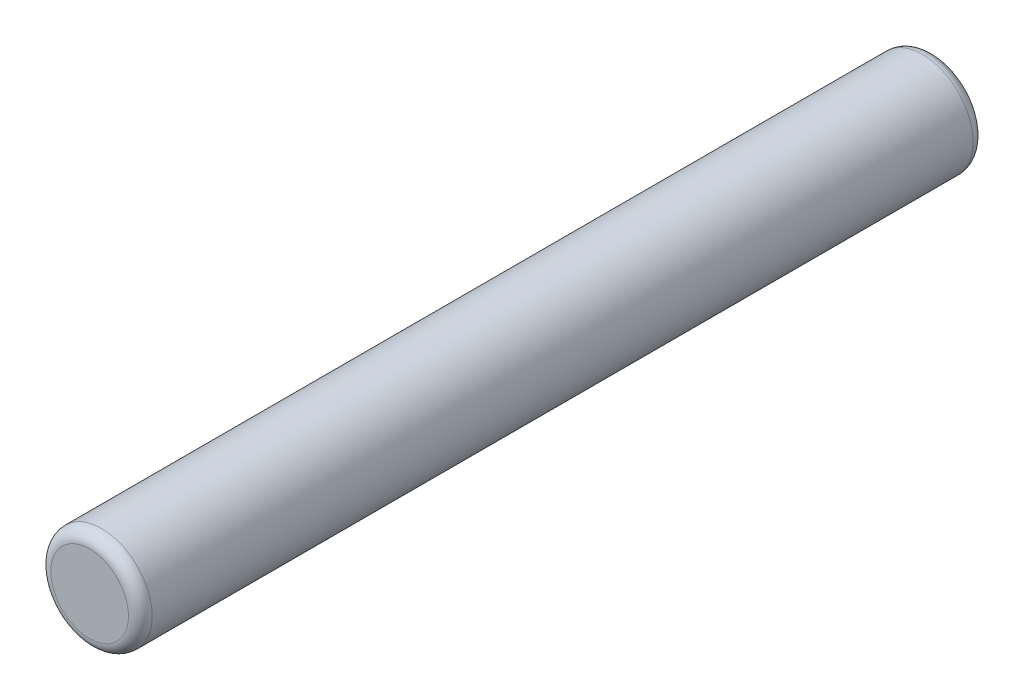
ISO-10303-21;
HEADER;
FILE_DESCRIPTION(('STEP AP214'),'2;1');
FILE_NAME('part.step','',(''),(''),'','','');
FILE_SCHEMA(('AUTOMOTIVE_DESIGN { 1 0 10303 214 1 1 1 1 }'));
ENDSEC;
DATA;
#1=APPLICATION_CONTEXT('core data for automotive mechanical design processes');
#2=APPLICATION_PROTOCOL_DEFINITION('international standard','automotive_design',2000,#1);
#3=PRODUCT_CONTEXT('',#1,'mechanical');
#4=PRODUCT('Part','Part','',(#3));
#5=PRODUCT_RELATED_PRODUCT_CATEGORY('part','',(#4));
#6=PRODUCT_DEFINITION_FORMATION('','',#4);
#7=PRODUCT_DEFINITION_CONTEXT('part definition',#1,'design');
#8=PRODUCT_DEFINITION('design','',#6,#7);
#9=PRODUCT_DEFINITION_SHAPE('','',#8);
#10=(LENGTH_UNIT() NAMED_UNIT(*) SI_UNIT(.MILLI.,.METRE.));
#11=(NAMED_UNIT(*) PLANE_ANGLE_UNIT() SI_UNIT($,.RADIAN.));
#12=(NAMED_UNIT(*) SI_UNIT($,.STERADIAN.) SOLID_ANGLE_UNIT());
#13=UNCERTAINTY_MEASURE_WITH_UNIT(LENGTH_MEASURE(1.E-05),#10,'distance_accuracy_value','');
#14=(GEOMETRIC_REPRESENTATION_CONTEXT(3) GLOBAL_UNCERTAINTY_ASSIGNED_CONTEXT((#13)) GLOBAL_UNIT_ASSIGNED_CONTEXT((#10,
#11,#12)) REPRESENTATION_CONTEXT('',''));
#15=CARTESIAN_POINT('',(0.,0.,0.));
#16=DIRECTION('',(0.,0.,1.));
#17=DIRECTION('',(1.,0.,0.));
#18=AXIS2_PLACEMENT_3D('',#15,#16,#17);
#19=CARTESIAN_POINT('',(0.,0.,12.5));
#20=DIRECTION('',(0.,0.,-1.));
#21=DIRECTION('',(-1.,0.,0.));
#22=AXIS2_PLACEMENT_3D('',#19,#20,#21);
#23=CYLINDRICAL_SURFACE('',#22,1.5);
#24=CARTESIAN_POINT('',(0.,0.,-12.15));
#25=DIRECTION('',(0.,0.,1.));
#26=DIRECTION('',(1.,0.,0.));
#27=AXIS2_PLACEMENT_3D('',#24,#25,#26);
#28=CIRCLE('',#27,1.5);
#29=CARTESIAN_POINT('',(1.5,0.,-12.15));
#30=VERTEX_POINT('',#29);
#31=EDGE_CURVE('E42',#30,#30,#28,.T.);
#32=ORIENTED_EDGE('',*,*,#31,.T.);
#33=EDGE_LOOP('',(#32));
#34=FACE_BOUND('',#33,.T.);
#35=CARTESIAN_POINT('',(0.,0.,12.15));
#36=DIRECTION('',(0.,0.,1.));
#37=DIRECTION('',(1.,0.,0.));
#38=AXIS2_PLACEMENT_3D('',#35,#36,#37);
#39=CIRCLE('',#38,1.5);
#40=CARTESIAN_POINT('',(1.5,0.,12.15));
#41=VERTEX_POINT('',#40);
#42=EDGE_CURVE('E46',#41,#41,#39,.F.);
#43=ORIENTED_EDGE('',*,*,#42,.T.);
#44=EDGE_LOOP('',(#43));
#45=FACE_BOUND('',#44,.T.);
#46=ADVANCED_FACE('F31',(#34,#45),#23,.T.);
#47=CARTESIAN_POINT('',(0.,0.,12.5));
#48=DIRECTION('',(0.,0.,1.));
#49=DIRECTION('',(1.,0.,0.));
#50=AXIS2_PLACEMENT_3D('',#47,#48,#49);
#51=PLANE('',#50);
#52=CARTESIAN_POINT('',(0.,0.,12.5));
#53=DIRECTION('',(0.,0.,1.));
#54=DIRECTION('',(1.,0.,0.));
#55=AXIS2_PLACEMENT_3D('',#52,#53,#54);
#56=CIRCLE('',#55,1.15);
#57=CARTESIAN_POINT('',(1.15,0.,12.5));
#58=VERTEX_POINT('',#57);
#59=EDGE_CURVE('E10',#58,#58,#56,.T.);
#60=ORIENTED_EDGE('',*,*,#59,.T.);
#61=EDGE_LOOP('',(#60));
#62=FACE_BOUND('',#61,.T.);
#63=ADVANCED_FACE('F62',(#62),#51,.T.);
#64=CARTESIAN_POINT('',(0.,0.,-12.5));
#65=DIRECTION('',(0.,0.,1.));
#66=DIRECTION('',(1.,0.,0.));
#67=AXIS2_PLACEMENT_3D('',#64,#65,#66);
#68=PLANE('',#67);
#69=CARTESIAN_POINT('',(0.,0.,-12.5));
#70=DIRECTION('',(0.,0.,1.));
#71=DIRECTION('',(1.,0.,0.));
#72=AXIS2_PLACEMENT_3D('',#69,#70,#71);
#73=CIRCLE('',#72,1.15);
#74=CARTESIAN_POINT('',(1.15,0.,-12.5));
#75=VERTEX_POINT('',#74);
#76=EDGE_CURVE('E38',#75,#75,#73,.F.);
#77=ORIENTED_EDGE('',*,*,#76,.T.);
#78=EDGE_LOOP('',(#77));
#79=FACE_BOUND('',#78,.T.);
#80=ADVANCED_FACE('F59',(#79),#68,.F.);
#81=CARTESIAN_POINT('',(0.,0.,-12.15));
#82=DIRECTION('',(0.,0.,1.));
#83=DIRECTION('',(1.,0.,0.));
#84=AXIS2_PLACEMENT_3D('',#81,#82,#83);
#85=TOROIDAL_SURFACE('',#84,1.15,0.35);
#86=ORIENTED_EDGE('',*,*,#76,.F.);
#87=EDGE_LOOP('',(#86));
#88=FACE_BOUND('',#87,.T.);
#89=ORIENTED_EDGE('',*,*,#31,.F.);
#90=EDGE_LOOP('',(#89));
#91=FACE_BOUND('',#90,.T.);
#92=ADVANCED_FACE('F55',(#88,#91),#85,.T.);
#93=CARTESIAN_POINT('',(0.,0.,12.15));
#94=DIRECTION('',(0.,0.,1.));
#95=DIRECTION('',(1.,0.,0.));
#96=AXIS2_PLACEMENT_3D('',#93,#94,#95);
#97=TOROIDAL_SURFACE('',#96,1.15,0.35);
#98=ORIENTED_EDGE('',*,*,#42,.F.);
#99=EDGE_LOOP('',(#98));
#100=FACE_BOUND('',#99,.T.);
#101=ORIENTED_EDGE('',*,*,#59,.F.);
#102=EDGE_LOOP('',(#101));
#103=FACE_BOUND('',#102,.T.);
#104=ADVANCED_FACE('F33',(#100,#103),#97,.T.);
#105=CLOSED_SHELL('',(#46,#63,#80,#92,#104));
#106=MANIFOLD_SOLID_BREP('B2',#105);
#107=ADVANCED_BREP_SHAPE_REPRESENTATION('',(#18,#106),#14);
#108=SHAPE_DEFINITION_REPRESENTATION(#9,#107);
ENDSEC;
END-ISO-10303-21;
